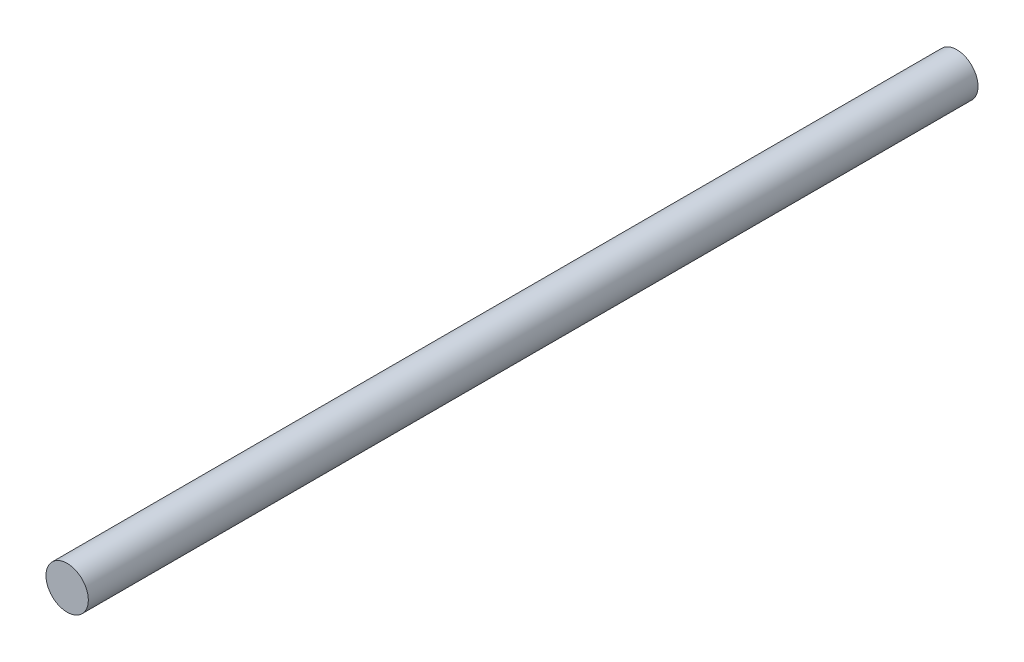
ISO-10303-21;
HEADER;
FILE_DESCRIPTION(('STEP AP214'),'2;1');
FILE_NAME('part.step','',(''),(''),'','','');
FILE_SCHEMA(('AUTOMOTIVE_DESIGN { 1 0 10303 214 1 1 1 1 }'));
ENDSEC;
DATA;
#1=APPLICATION_CONTEXT('core data for automotive mechanical design processes');
#2=APPLICATION_PROTOCOL_DEFINITION('international standard','automotive_design',2000,#1);
#3=PRODUCT_CONTEXT('',#1,'mechanical');
#4=PRODUCT('Part','Part','',(#3));
#5=PRODUCT_RELATED_PRODUCT_CATEGORY('part','',(#4));
#6=PRODUCT_DEFINITION_FORMATION('','',#4);
#7=PRODUCT_DEFINITION_CONTEXT('part definition',#1,'design');
#8=PRODUCT_DEFINITION('design','',#6,#7);
#9=PRODUCT_DEFINITION_SHAPE('','',#8);
#10=(LENGTH_UNIT() NAMED_UNIT(*) SI_UNIT(.MILLI.,.METRE.));
#11=(NAMED_UNIT(*) PLANE_ANGLE_UNIT() SI_UNIT($,.RADIAN.));
#12=(NAMED_UNIT(*) SI_UNIT($,.STERADIAN.) SOLID_ANGLE_UNIT());
#13=UNCERTAINTY_MEASURE_WITH_UNIT(LENGTH_MEASURE(1.E-05),#10,'distance_accuracy_value','');
#14=(GEOMETRIC_REPRESENTATION_CONTEXT(3) GLOBAL_UNCERTAINTY_ASSIGNED_CONTEXT((#13)) GLOBAL_UNIT_ASSIGNED_CONTEXT((#10,
#11,#12)) REPRESENTATION_CONTEXT('',''));
#15=CARTESIAN_POINT('',(0.,0.,0.));
#16=DIRECTION('',(0.,0.,1.));
#17=DIRECTION('',(1.,0.,0.));
#18=AXIS2_PLACEMENT_3D('',#15,#16,#17);
#19=CARTESIAN_POINT('',(-0.573038224978647,-0.819528640569274,42.));
#20=DIRECTION('',(0.,0.,-1.));
#21=DIRECTION('',(-1.,0.,0.));
#22=AXIS2_PLACEMENT_3D('',#19,#20,#21);
#23=CYLINDRICAL_SURFACE('',#22,1.);
#24=CARTESIAN_POINT('',(-0.573038224978647,-0.819528640569274,42.));
#25=DIRECTION('',(0.,0.,1.));
#26=DIRECTION('',(1.,0.,0.));
#27=AXIS2_PLACEMENT_3D('',#24,#25,#26);
#28=CIRCLE('',#27,1.);
#29=CARTESIAN_POINT('',(0.426961775021354,-0.819528640569274,42.));
#30=VERTEX_POINT('',#29);
#31=EDGE_CURVE('E10',#30,#30,#28,.T.);
#32=ORIENTED_EDGE('',*,*,#31,.F.);
#33=EDGE_LOOP('',(#32));
#34=FACE_BOUND('',#33,.T.);
#35=CARTESIAN_POINT('',(-0.573038224978647,-0.819528640569274,0.));
#36=DIRECTION('',(0.,0.,1.));
#37=DIRECTION('',(1.,0.,0.));
#38=AXIS2_PLACEMENT_3D('',#35,#36,#37);
#39=CIRCLE('',#38,1.);
#40=CARTESIAN_POINT('',(0.426961775021354,-0.819528640569274,0.));
#41=VERTEX_POINT('',#40);
#42=EDGE_CURVE('E42',#41,#41,#39,.T.);
#43=ORIENTED_EDGE('',*,*,#42,.T.);
#44=EDGE_LOOP('',(#43));
#45=FACE_BOUND('',#44,.T.);
#46=ADVANCED_FACE('F39',(#34,#45),#23,.T.);
#47=CARTESIAN_POINT('',(-0.573038224978647,-0.819528640569274,42.));
#48=DIRECTION('',(0.,0.,1.));
#49=DIRECTION('',(1.,0.,0.));
#50=AXIS2_PLACEMENT_3D('',#47,#48,#49);
#51=PLANE('',#50);
#52=ORIENTED_EDGE('',*,*,#31,.T.);
#53=EDGE_LOOP('',(#52));
#54=FACE_BOUND('',#53,.T.);
#55=ADVANCED_FACE('F56',(#54),#51,.T.);
#56=CARTESIAN_POINT('',(-0.573038224978647,-0.819528640569274,0.));
#57=DIRECTION('',(0.,0.,1.));
#58=DIRECTION('',(1.,0.,0.));
#59=AXIS2_PLACEMENT_3D('',#56,#57,#58);
#60=PLANE('',#59);
#61=ORIENTED_EDGE('',*,*,#42,.F.);
#62=EDGE_LOOP('',(#61));
#63=FACE_BOUND('',#62,.T.);
#64=ADVANCED_FACE('F54',(#63),#60,.F.);
#65=CLOSED_SHELL('',(#46,#55,#64));
#66=MANIFOLD_SOLID_BREP('B2',#65);
#67=ADVANCED_BREP_SHAPE_REPRESENTATION('',(#18,#66),#14);
#68=SHAPE_DEFINITION_REPRESENTATION(#9,#67);
ENDSEC;
END-ISO-10303-21;
